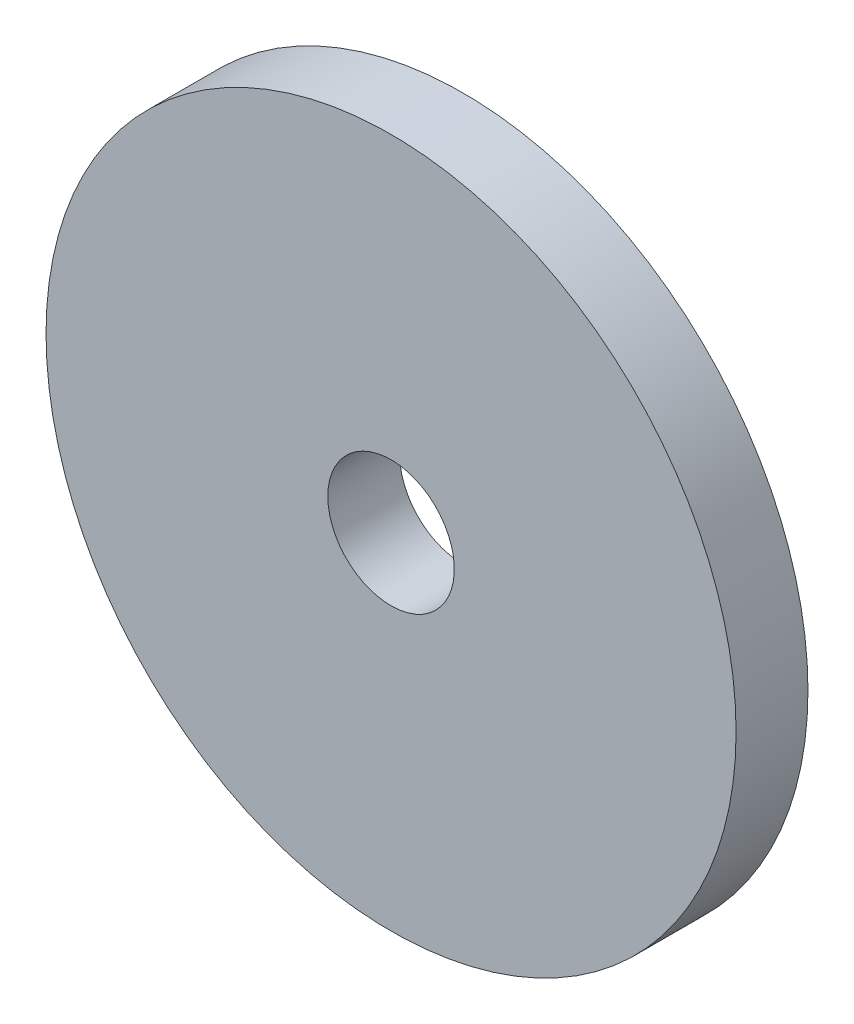
ISO-10303-21;
HEADER;
FILE_DESCRIPTION(('STEP AP214'),'2;1');
FILE_NAME('part.step','',(''),(''),'','','');
FILE_SCHEMA(('AUTOMOTIVE_DESIGN { 1 0 10303 214 1 1 1 1 }'));
ENDSEC;
DATA;
#1=APPLICATION_CONTEXT('core data for automotive mechanical design processes');
#2=APPLICATION_PROTOCOL_DEFINITION('international standard','automotive_design',2000,#1);
#3=PRODUCT_CONTEXT('',#1,'mechanical');
#4=PRODUCT('Part','Part','',(#3));
#5=PRODUCT_RELATED_PRODUCT_CATEGORY('part','',(#4));
#6=PRODUCT_DEFINITION_FORMATION('','',#4);
#7=PRODUCT_DEFINITION_CONTEXT('part definition',#1,'design');
#8=PRODUCT_DEFINITION('design','',#6,#7);
#9=PRODUCT_DEFINITION_SHAPE('','',#8);
#10=(LENGTH_UNIT() NAMED_UNIT(*) SI_UNIT(.MILLI.,.METRE.));
#11=(NAMED_UNIT(*) PLANE_ANGLE_UNIT() SI_UNIT($,.RADIAN.));
#12=(NAMED_UNIT(*) SI_UNIT($,.STERADIAN.) SOLID_ANGLE_UNIT());
#13=UNCERTAINTY_MEASURE_WITH_UNIT(LENGTH_MEASURE(1.E-05),#10,'distance_accuracy_value','');
#14=(GEOMETRIC_REPRESENTATION_CONTEXT(3) GLOBAL_UNCERTAINTY_ASSIGNED_CONTEXT((#13)) GLOBAL_UNIT_ASSIGNED_CONTEXT((#10,
#11,#12)) REPRESENTATION_CONTEXT('',''));
#15=CARTESIAN_POINT('',(0.,0.,0.));
#16=DIRECTION('',(0.,0.,1.));
#17=DIRECTION('',(1.,0.,0.));
#18=AXIS2_PLACEMENT_3D('',#15,#16,#17);
#19=CARTESIAN_POINT('',(18.0428340261423,47.3469284652771,450.582827844799));
#20=DIRECTION('',(0.,0.,1.));
#21=DIRECTION('',(1.,0.,0.));
#22=AXIS2_PLACEMENT_3D('',#19,#20,#21);
#23=CYLINDRICAL_SURFACE('',#22,6.00000000000001);
#24=CARTESIAN_POINT('',(18.0428340261423,47.3469284652771,468.803390593276));
#25=DIRECTION('',(0.,0.,-1.));
#26=DIRECTION('',(-1.,0.,0.));
#27=AXIS2_PLACEMENT_3D('',#24,#25,#26);
#28=CIRCLE('',#27,6.00000000000001);
#29=CARTESIAN_POINT('',(12.0428340261423,47.3469284652771,468.803390593276));
#30=VERTEX_POINT('',#29);
#31=EDGE_CURVE('E40',#30,#30,#28,.T.);
#32=ORIENTED_EDGE('',*,*,#31,.T.);
#33=EDGE_LOOP('',(#32));
#34=FACE_BOUND('',#33,.T.);
#35=CARTESIAN_POINT('',(18.0428340261423,47.3469284652771,467.553390593276));
#36=DIRECTION('',(0.,0.,-1.));
#37=DIRECTION('',(-1.,0.,0.));
#38=AXIS2_PLACEMENT_3D('',#35,#36,#37);
#39=CIRCLE('',#38,6.00000000000001);
#40=CARTESIAN_POINT('',(12.0428340261423,47.3469284652771,467.553390593276));
#41=VERTEX_POINT('',#40);
#42=EDGE_CURVE('E10',#41,#41,#39,.T.);
#43=ORIENTED_EDGE('',*,*,#42,.F.);
#44=EDGE_LOOP('',(#43));
#45=FACE_BOUND('',#44,.T.);
#46=ADVANCED_FACE('F33',(#34,#45),#23,.T.);
#47=CARTESIAN_POINT('',(18.0428340261423,47.3469284652771,468.803390593276));
#48=DIRECTION('',(0.,0.,-1.));
#49=DIRECTION('',(-1.,0.,0.));
#50=AXIS2_PLACEMENT_3D('',#47,#48,#49);
#51=PLANE('',#50);
#52=ORIENTED_EDGE('',*,*,#31,.F.);
#53=EDGE_LOOP('',(#52));
#54=FACE_BOUND('',#53,.T.);
#55=CARTESIAN_POINT('',(18.0428340261423,47.3469284652771,468.803390593276));
#56=DIRECTION('',(0.,0.,-1.));
#57=DIRECTION('',(-1.,0.,0.));
#58=AXIS2_PLACEMENT_3D('',#55,#56,#57);
#59=CIRCLE('',#58,1.09999999999999);
#60=CARTESIAN_POINT('',(16.9428340261423,47.3469284652771,468.803390593276));
#61=VERTEX_POINT('',#60);
#62=EDGE_CURVE('E45',#61,#61,#59,.T.);
#63=ORIENTED_EDGE('',*,*,#62,.T.);
#64=EDGE_LOOP('',(#63));
#65=FACE_BOUND('',#64,.T.);
#66=ADVANCED_FACE('F61',(#54,#65),#51,.F.);
#67=CARTESIAN_POINT('',(18.0428340261423,47.3469284652771,450.582827844799));
#68=DIRECTION('',(0.,0.,1.));
#69=DIRECTION('',(1.,0.,0.));
#70=AXIS2_PLACEMENT_3D('',#67,#68,#69);
#71=CYLINDRICAL_SURFACE('',#70,1.09999999999999);
#72=ORIENTED_EDGE('',*,*,#62,.F.);
#73=EDGE_LOOP('',(#72));
#74=FACE_BOUND('',#73,.T.);
#75=CARTESIAN_POINT('',(18.0428340261423,47.3469284652771,467.553390593276));
#76=DIRECTION('',(0.,0.,-1.));
#77=DIRECTION('',(-1.,0.,0.));
#78=AXIS2_PLACEMENT_3D('',#75,#76,#77);
#79=CIRCLE('',#78,1.09999999999999);
#80=CARTESIAN_POINT('',(16.9428340261423,47.3469284652771,467.553390593276));
#81=VERTEX_POINT('',#80);
#82=EDGE_CURVE('E36',#81,#81,#79,.T.);
#83=ORIENTED_EDGE('',*,*,#82,.T.);
#84=EDGE_LOOP('',(#83));
#85=FACE_BOUND('',#84,.T.);
#86=ADVANCED_FACE('F53',(#74,#85),#71,.F.);
#87=CARTESIAN_POINT('',(3.50000000000002,49.1953945374974,467.553390593276));
#88=DIRECTION('',(0.,0.,-1.));
#89=DIRECTION('',(-1.,0.,0.));
#90=AXIS2_PLACEMENT_3D('',#87,#88,#89);
#91=PLANE('',#90);
#92=ORIENTED_EDGE('',*,*,#82,.F.);
#93=EDGE_LOOP('',(#92));
#94=FACE_BOUND('',#93,.T.);
#95=ORIENTED_EDGE('',*,*,#42,.T.);
#96=EDGE_LOOP('',(#95));
#97=FACE_BOUND('',#96,.T.);
#98=ADVANCED_FACE('F55',(#94,#97),#91,.T.);
#99=CLOSED_SHELL('',(#46,#66,#86,#98));
#100=MANIFOLD_SOLID_BREP('B2',#99);
#101=ADVANCED_BREP_SHAPE_REPRESENTATION('',(#18,#100),#14);
#102=SHAPE_DEFINITION_REPRESENTATION(#9,#101);
ENDSEC;
END-ISO-10303-21;
